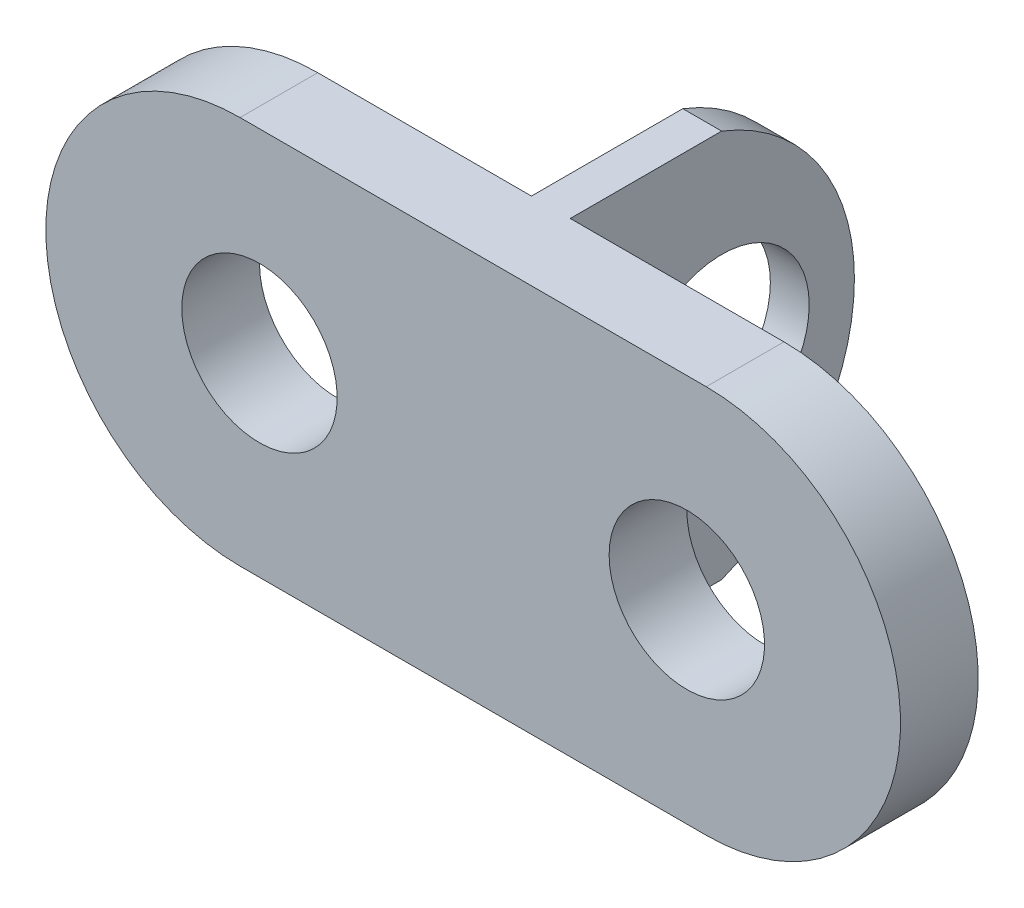
ISO-10303-21;
HEADER;
FILE_DESCRIPTION(('STEP AP214'),'2;1');
FILE_NAME('part.step','',(''),(''),'','','');
FILE_SCHEMA(('AUTOMOTIVE_DESIGN { 1 0 10303 214 1 1 1 1 }'));
ENDSEC;
DATA;
#1=APPLICATION_CONTEXT('core data for automotive mechanical design processes');
#2=APPLICATION_PROTOCOL_DEFINITION('international standard','automotive_design',2000,#1);
#3=PRODUCT_CONTEXT('',#1,'mechanical');
#4=PRODUCT('Part','Part','',(#3));
#5=PRODUCT_RELATED_PRODUCT_CATEGORY('part','',(#4));
#6=PRODUCT_DEFINITION_FORMATION('','',#4);
#7=PRODUCT_DEFINITION_CONTEXT('part definition',#1,'design');
#8=PRODUCT_DEFINITION('design','',#6,#7);
#9=PRODUCT_DEFINITION_SHAPE('','',#8);
#10=(LENGTH_UNIT() NAMED_UNIT(*) SI_UNIT(.MILLI.,.METRE.));
#11=(NAMED_UNIT(*) PLANE_ANGLE_UNIT() SI_UNIT($,.RADIAN.));
#12=(NAMED_UNIT(*) SI_UNIT($,.STERADIAN.) SOLID_ANGLE_UNIT());
#13=UNCERTAINTY_MEASURE_WITH_UNIT(LENGTH_MEASURE(1.E-05),#10,'distance_accuracy_value','');
#14=(GEOMETRIC_REPRESENTATION_CONTEXT(3) GLOBAL_UNCERTAINTY_ASSIGNED_CONTEXT((#13)) GLOBAL_UNIT_ASSIGNED_CONTEXT((#10,
#11,#12)) REPRESENTATION_CONTEXT('',''));
#15=CARTESIAN_POINT('',(0.,0.,0.));
#16=DIRECTION('',(0.,0.,1.));
#17=DIRECTION('',(1.,0.,0.));
#18=AXIS2_PLACEMENT_3D('',#15,#16,#17);
#19=CARTESIAN_POINT('',(-2.79518072289156,-4.93172690763052,0.));
#20=DIRECTION('',(0.,0.,1.));
#21=DIRECTION('',(1.,0.,0.));
#22=AXIS2_PLACEMENT_3D('',#19,#20,#21);
#23=PLANE('',#22);
#24=CARTESIAN_POINT('',(-1.79518072289156,-4.93172690763052,0.));
#25=DIRECTION('',(0.,0.,-1.));
#26=DIRECTION('',(-1.,0.,0.));
#27=AXIS2_PLACEMENT_3D('',#24,#25,#26);
#28=CIRCLE('',#27,4.);
#29=CARTESIAN_POINT('',(-5.79518072289156,-4.93172690763052,0.));
#30=VERTEX_POINT('',#29);
#31=EDGE_CURVE('E191',#30,#30,#28,.T.);
#32=ORIENTED_EDGE('',*,*,#31,.F.);
#33=EDGE_LOOP('',(#32));
#34=FACE_BOUND('',#33,.T.);
#35=DIRECTION('',(-1.,0.,0.));
#36=VECTOR('',#35,1.);
#37=CARTESIAN_POINT('',(-2.79518072289156,5.06827309236948,0.));
#38=LINE('',#37,#36);
#39=CARTESIAN_POINT('',(8.20481927710844,5.06827309236948,0.));
#40=VERTEX_POINT('',#39);
#41=CARTESIAN_POINT('',(-2.79518072289156,5.06827309236948,0.));
#42=VERTEX_POINT('',#41);
#43=EDGE_CURVE('E162',#40,#42,#38,.T.);
#44=ORIENTED_EDGE('',*,*,#43,.F.);
#45=DIRECTION('',(0.,-1.,0.));
#46=VECTOR('',#45,1.);
#47=CARTESIAN_POINT('',(8.20481927710844,5.06827309236948,0.));
#48=LINE('',#47,#46);
#49=CARTESIAN_POINT('',(8.20481927710844,-14.9317269076305,0.));
#50=VERTEX_POINT('',#49);
#51=EDGE_CURVE('E174',#40,#50,#48,.T.);
#52=ORIENTED_EDGE('',*,*,#51,.T.);
#53=DIRECTION('',(1.,0.,0.));
#54=VECTOR('',#53,1.);
#55=CARTESIAN_POINT('',(-2.79518072289156,-14.9317269076305,0.));
#56=LINE('',#55,#54);
#57=CARTESIAN_POINT('',(-2.79518072289156,-14.9317269076305,0.));
#58=VERTEX_POINT('',#57);
#59=EDGE_CURVE('E157',#58,#50,#56,.T.);
#60=ORIENTED_EDGE('',*,*,#59,.F.);
#61=CARTESIAN_POINT('',(-2.79518072289156,-4.93172690763052,0.));
#62=DIRECTION('',(0.,0.,1.));
#63=DIRECTION('',(1.,0.,0.));
#64=AXIS2_PLACEMENT_3D('',#61,#62,#63);
#65=CIRCLE('',#64,10.);
#66=EDGE_CURVE('E133',#42,#58,#65,.T.);
#67=ORIENTED_EDGE('',*,*,#66,.F.);
#68=EDGE_LOOP('',(#44,#52,#60,#67));
#69=FACE_BOUND('',#68,.T.);
#70=ADVANCED_FACE('F52',(#34,#69),#23,.F.);
#71=CARTESIAN_POINT('',(-2.79518072289156,-4.93172690763052,4.));
#72=DIRECTION('',(0.,0.,-1.));
#73=DIRECTION('',(-1.,0.,0.));
#74=AXIS2_PLACEMENT_3D('',#71,#72,#73);
#75=CYLINDRICAL_SURFACE('',#74,10.);
#76=ORIENTED_EDGE('',*,*,#66,.T.);
#77=DIRECTION('',(0.,0.,-1.));
#78=VECTOR('',#77,1.);
#79=CARTESIAN_POINT('',(-2.79518072289156,-14.9317269076305,4.));
#80=LINE('',#79,#78);
#81=CARTESIAN_POINT('',(-2.79518072289156,-14.9317269076305,4.));
#82=VERTEX_POINT('',#81);
#83=EDGE_CURVE('E60',#82,#58,#80,.T.);
#84=ORIENTED_EDGE('',*,*,#83,.F.);
#85=CARTESIAN_POINT('',(-2.79518072289156,-4.93172690763052,4.));
#86=DIRECTION('',(0.,0.,1.));
#87=DIRECTION('',(1.,0.,0.));
#88=AXIS2_PLACEMENT_3D('',#85,#86,#87);
#89=CIRCLE('',#88,10.);
#90=CARTESIAN_POINT('',(-2.79518072289156,5.06827309236948,4.));
#91=VERTEX_POINT('',#90);
#92=EDGE_CURVE('E147',#91,#82,#89,.T.);
#93=ORIENTED_EDGE('',*,*,#92,.F.);
#94=DIRECTION('',(0.,0.,-1.));
#95=VECTOR('',#94,1.);
#96=CARTESIAN_POINT('',(-2.79518072289156,5.06827309236948,4.));
#97=LINE('',#96,#95);
#98=EDGE_CURVE('E155',#91,#42,#97,.T.);
#99=ORIENTED_EDGE('',*,*,#98,.T.);
#100=EDGE_LOOP('',(#76,#84,#93,#99));
#101=FACE_BOUND('',#100,.T.);
#102=ADVANCED_FACE('F54',(#101),#75,.T.);
#103=CARTESIAN_POINT('',(-2.79518072289156,-14.9317269076305,4.));
#104=DIRECTION('',(0.,1.,0.));
#105=DIRECTION('',(0.,0.,1.));
#106=AXIS2_PLACEMENT_3D('',#103,#104,#105);
#107=PLANE('',#106);
#108=DIRECTION('',(0.,0.,1.));
#109=VECTOR('',#108,1.);
#110=CARTESIAN_POINT('',(8.20481927710844,-14.9317269076305,-15.));
#111=LINE('',#110,#109);
#112=CARTESIAN_POINT('',(8.20481927710844,-14.9317269076305,-7.79247856892908));
#113=VERTEX_POINT('',#112);
#114=EDGE_CURVE('E138',#113,#50,#111,.T.);
#115=ORIENTED_EDGE('',*,*,#114,.F.);
#116=DIRECTION('',(1.,0.,0.));
#117=VECTOR('',#116,1.);
#118=CARTESIAN_POINT('',(-12.7951807228916,-14.9317269076305,-7.79247856892908));
#119=LINE('',#118,#117);
#120=CARTESIAN_POINT('',(10.2048192771084,-14.9317269076305,-7.79247856892908));
#121=VERTEX_POINT('',#120);
#122=EDGE_CURVE('E66',#113,#121,#119,.T.);
#123=ORIENTED_EDGE('',*,*,#122,.T.);
#124=DIRECTION('',(0.,0.,1.));
#125=VECTOR('',#124,1.);
#126=CARTESIAN_POINT('',(10.2048192771084,-14.9317269076305,-15.));
#127=LINE('',#126,#125);
#128=CARTESIAN_POINT('',(10.2048192771084,-14.9317269076305,0.));
#129=VERTEX_POINT('',#128);
#130=EDGE_CURVE('E125',#121,#129,#127,.T.);
#131=ORIENTED_EDGE('',*,*,#130,.T.);
#132=CARTESIAN_POINT('',(21.2048192771084,-14.9317269076305,0.));
#133=VERTEX_POINT('',#132);
#134=EDGE_CURVE('E136',#129,#133,#56,.T.);
#135=ORIENTED_EDGE('',*,*,#134,.T.);
#136=DIRECTION('',(0.,0.,-1.));
#137=VECTOR('',#136,1.);
#138=CARTESIAN_POINT('',(21.2048192771084,-14.9317269076305,4.));
#139=LINE('',#138,#137);
#140=CARTESIAN_POINT('',(21.2048192771084,-14.9317269076305,4.));
#141=VERTEX_POINT('',#140);
#142=EDGE_CURVE('E168',#141,#133,#139,.T.);
#143=ORIENTED_EDGE('',*,*,#142,.F.);
#144=DIRECTION('',(1.,0.,0.));
#145=VECTOR('',#144,1.);
#146=CARTESIAN_POINT('',(-2.79518072289156,-14.9317269076305,4.));
#147=LINE('',#146,#145);
#148=EDGE_CURVE('E150',#82,#141,#147,.T.);
#149=ORIENTED_EDGE('',*,*,#148,.F.);
#150=ORIENTED_EDGE('',*,*,#83,.T.);
#151=ORIENTED_EDGE('',*,*,#59,.T.);
#152=EDGE_LOOP('',(#115,#123,#131,#135,#143,#149,#150,#151));
#153=FACE_BOUND('',#152,.T.);
#154=ADVANCED_FACE('F229',(#153),#107,.F.);
#155=CARTESIAN_POINT('',(21.2048192771084,-4.93172690763052,4.));
#156=DIRECTION('',(0.,0.,-1.));
#157=DIRECTION('',(-1.,0.,0.));
#158=AXIS2_PLACEMENT_3D('',#155,#156,#157);
#159=CYLINDRICAL_SURFACE('',#158,10.);
#160=CARTESIAN_POINT('',(21.2048192771084,-4.93172690763052,0.));
#161=DIRECTION('',(0.,0.,1.));
#162=DIRECTION('',(-1.,0.,0.));
#163=AXIS2_PLACEMENT_3D('',#160,#161,#162);
#164=CIRCLE('',#163,10.);
#165=CARTESIAN_POINT('',(21.2048192771084,5.06827309236948,0.));
#166=VERTEX_POINT('',#165);
#167=EDGE_CURVE('E160',#133,#166,#164,.T.);
#168=ORIENTED_EDGE('',*,*,#167,.T.);
#169=DIRECTION('',(0.,0.,-1.));
#170=VECTOR('',#169,1.);
#171=CARTESIAN_POINT('',(21.2048192771084,5.06827309236948,4.));
#172=LINE('',#171,#170);
#173=CARTESIAN_POINT('',(21.2048192771084,5.06827309236948,4.));
#174=VERTEX_POINT('',#173);
#175=EDGE_CURVE('E166',#174,#166,#172,.T.);
#176=ORIENTED_EDGE('',*,*,#175,.F.);
#177=CARTESIAN_POINT('',(21.2048192771084,-4.93172690763052,4.));
#178=DIRECTION('',(0.,0.,1.));
#179=DIRECTION('',(-1.,0.,0.));
#180=AXIS2_PLACEMENT_3D('',#177,#178,#179);
#181=CIRCLE('',#180,10.);
#182=EDGE_CURVE('E152',#141,#174,#181,.T.);
#183=ORIENTED_EDGE('',*,*,#182,.F.);
#184=ORIENTED_EDGE('',*,*,#142,.T.);
#185=EDGE_LOOP('',(#168,#176,#183,#184));
#186=FACE_BOUND('',#185,.T.);
#187=ADVANCED_FACE('F230',(#186),#159,.T.);
#188=CARTESIAN_POINT('',(-2.79518072289156,5.06827309236948,4.));
#189=DIRECTION('',(0.,-1.,0.));
#190=DIRECTION('',(1.,0.,0.));
#191=AXIS2_PLACEMENT_3D('',#188,#189,#190);
#192=PLANE('',#191);
#193=DIRECTION('',(0.,0.,1.));
#194=VECTOR('',#193,1.);
#195=CARTESIAN_POINT('',(10.2048192771084,5.06827309236948,-15.));
#196=LINE('',#195,#194);
#197=CARTESIAN_POINT('',(10.2048192771084,5.06827309236948,-7.79247856892908));
#198=VERTEX_POINT('',#197);
#199=CARTESIAN_POINT('',(10.2048192771084,5.06827309236948,0.));
#200=VERTEX_POINT('',#199);
#201=EDGE_CURVE('E74',#198,#200,#196,.T.);
#202=ORIENTED_EDGE('',*,*,#201,.F.);
#203=DIRECTION('',(1.,0.,0.));
#204=VECTOR('',#203,1.);
#205=CARTESIAN_POINT('',(-12.7951807228916,5.06827309236948,-7.79247856892908));
#206=LINE('',#205,#204);
#207=CARTESIAN_POINT('',(8.20481927710844,5.06827309236948,-7.79247856892908));
#208=VERTEX_POINT('',#207);
#209=EDGE_CURVE('E116',#208,#198,#206,.T.);
#210=ORIENTED_EDGE('',*,*,#209,.F.);
#211=DIRECTION('',(0.,0.,1.));
#212=VECTOR('',#211,1.);
#213=CARTESIAN_POINT('',(8.20481927710844,5.06827309236948,-15.));
#214=LINE('',#213,#212);
#215=EDGE_CURVE('E145',#208,#40,#214,.T.);
#216=ORIENTED_EDGE('',*,*,#215,.T.);
#217=ORIENTED_EDGE('',*,*,#43,.T.);
#218=ORIENTED_EDGE('',*,*,#98,.F.);
#219=DIRECTION('',(-1.,0.,0.));
#220=VECTOR('',#219,1.);
#221=CARTESIAN_POINT('',(-2.79518072289156,5.06827309236948,4.));
#222=LINE('',#221,#220);
#223=EDGE_CURVE('E154',#174,#91,#222,.T.);
#224=ORIENTED_EDGE('',*,*,#223,.F.);
#225=ORIENTED_EDGE('',*,*,#175,.T.);
#226=EDGE_CURVE('E132',#166,#200,#38,.T.);
#227=ORIENTED_EDGE('',*,*,#226,.T.);
#228=EDGE_LOOP('',(#202,#210,#216,#217,#218,#224,#225,#227));
#229=FACE_BOUND('',#228,.T.);
#230=ADVANCED_FACE('F129',(#229),#192,.F.);
#231=CARTESIAN_POINT('',(-2.79518072289156,-4.93172690763052,4.));
#232=DIRECTION('',(0.,0.,1.));
#233=DIRECTION('',(1.,0.,0.));
#234=AXIS2_PLACEMENT_3D('',#231,#232,#233);
#235=PLANE('',#234);
#236=CARTESIAN_POINT('',(-1.79518072289156,-4.93172690763052,4.));
#237=DIRECTION('',(0.,0.,-1.));
#238=DIRECTION('',(-1.,0.,0.));
#239=AXIS2_PLACEMENT_3D('',#236,#237,#238);
#240=CIRCLE('',#239,4.);
#241=CARTESIAN_POINT('',(-5.79518072289156,-4.93172690763052,4.));
#242=VERTEX_POINT('',#241);
#243=EDGE_CURVE('E188',#242,#242,#240,.T.);
#244=ORIENTED_EDGE('',*,*,#243,.T.);
#245=EDGE_LOOP('',(#244));
#246=FACE_BOUND('',#245,.T.);
#247=CARTESIAN_POINT('',(20.2048192771084,-4.93172690763052,4.));
#248=DIRECTION('',(0.,0.,-1.));
#249=DIRECTION('',(-1.,0.,0.));
#250=AXIS2_PLACEMENT_3D('',#247,#248,#249);
#251=CIRCLE('',#250,4.);
#252=CARTESIAN_POINT('',(16.2048192771084,-4.93172690763052,4.));
#253=VERTEX_POINT('',#252);
#254=EDGE_CURVE('E126',#253,#253,#251,.T.);
#255=ORIENTED_EDGE('',*,*,#254,.T.);
#256=EDGE_LOOP('',(#255));
#257=FACE_BOUND('',#256,.T.);
#258=ORIENTED_EDGE('',*,*,#92,.T.);
#259=ORIENTED_EDGE('',*,*,#148,.T.);
#260=ORIENTED_EDGE('',*,*,#182,.T.);
#261=ORIENTED_EDGE('',*,*,#223,.T.);
#262=EDGE_LOOP('',(#258,#259,#260,#261));
#263=FACE_BOUND('',#262,.T.);
#264=ADVANCED_FACE('F197',(#246,#257,#263),#235,.T.);
#265=CARTESIAN_POINT('',(20.2048192771084,-4.93172690763052,0.));
#266=DIRECTION('',(0.,0.,-1.));
#267=DIRECTION('',(-1.,0.,0.));
#268=AXIS2_PLACEMENT_3D('',#265,#266,#267);
#269=CIRCLE('',#268,4.);
#270=CARTESIAN_POINT('',(16.2048192771084,-4.93172690763052,0.));
#271=VERTEX_POINT('',#270);
#272=EDGE_CURVE('E185',#271,#271,#269,.T.);
#273=ORIENTED_EDGE('',*,*,#272,.F.);
#274=EDGE_LOOP('',(#273));
#275=FACE_BOUND('',#274,.T.);
#276=ORIENTED_EDGE('',*,*,#134,.F.);
#277=DIRECTION('',(0.,1.,0.));
#278=VECTOR('',#277,1.);
#279=CARTESIAN_POINT('',(10.2048192771084,-14.9317269076305,0.));
#280=LINE('',#279,#278);
#281=EDGE_CURVE('E141',#129,#200,#280,.T.);
#282=ORIENTED_EDGE('',*,*,#281,.T.);
#283=ORIENTED_EDGE('',*,*,#226,.F.);
#284=ORIENTED_EDGE('',*,*,#167,.F.);
#285=EDGE_LOOP('',(#276,#282,#283,#284));
#286=FACE_BOUND('',#285,.T.);
#287=ADVANCED_FACE('F210',(#275,#286),#23,.F.);
#288=CARTESIAN_POINT('',(10.2048192771084,-14.9317269076305,-15.));
#289=DIRECTION('',(1.,0.,0.));
#290=DIRECTION('',(0.,0.,-1.));
#291=AXIS2_PLACEMENT_3D('',#288,#289,#290);
#292=PLANE('',#291);
#293=CARTESIAN_POINT('',(10.2048192771084,-4.93172690763052,-3.89623928446454));
#294=DIRECTION('',(1.,0.,0.));
#295=DIRECTION('',(0.,0.,-1.));
#296=AXIS2_PLACEMENT_3D('',#293,#294,#295);
#297=CIRCLE('',#296,10.7322262630735);
#298=EDGE_CURVE('E118',#198,#121,#297,.F.);
#299=ORIENTED_EDGE('',*,*,#298,.F.);
#300=ORIENTED_EDGE('',*,*,#201,.T.);
#301=ORIENTED_EDGE('',*,*,#281,.F.);
#302=ORIENTED_EDGE('',*,*,#130,.F.);
#303=EDGE_LOOP('',(#299,#300,#301,#302));
#304=FACE_BOUND('',#303,.T.);
#305=CARTESIAN_POINT('',(10.2048192771084,-4.93172690763052,-7.8));
#306=DIRECTION('',(1.,0.,0.));
#307=DIRECTION('',(0.,0.,-1.));
#308=AXIS2_PLACEMENT_3D('',#305,#306,#307);
#309=CIRCLE('',#308,4.5);
#310=CARTESIAN_POINT('',(10.2048192771084,-4.93172690763052,-12.3));
#311=VERTEX_POINT('',#310);
#312=EDGE_CURVE('E175',#311,#311,#309,.T.);
#313=ORIENTED_EDGE('',*,*,#312,.F.);
#314=EDGE_LOOP('',(#313));
#315=FACE_BOUND('',#314,.T.);
#316=ADVANCED_FACE('F123',(#304,#315),#292,.T.);
#317=CARTESIAN_POINT('',(8.20481927710844,5.06827309236948,-15.));
#318=DIRECTION('',(-1.,0.,0.));
#319=DIRECTION('',(0.,-1.,0.));
#320=AXIS2_PLACEMENT_3D('',#317,#318,#319);
#321=PLANE('',#320);
#322=CARTESIAN_POINT('',(8.20481927710844,-4.93172690763052,-3.89623928446454));
#323=DIRECTION('',(-1.,0.,0.));
#324=DIRECTION('',(0.,-1.,0.));
#325=AXIS2_PLACEMENT_3D('',#322,#323,#324);
#326=CIRCLE('',#325,10.7322262630735);
#327=EDGE_CURVE('E12',#113,#208,#326,.F.);
#328=ORIENTED_EDGE('',*,*,#327,.F.);
#329=ORIENTED_EDGE('',*,*,#114,.T.);
#330=ORIENTED_EDGE('',*,*,#51,.F.);
#331=ORIENTED_EDGE('',*,*,#215,.F.);
#332=EDGE_LOOP('',(#328,#329,#330,#331));
#333=FACE_BOUND('',#332,.T.);
#334=CARTESIAN_POINT('',(8.20481927710844,-4.93172690763052,-7.8));
#335=DIRECTION('',(-1.,0.,0.));
#336=DIRECTION('',(0.,-1.,0.));
#337=AXIS2_PLACEMENT_3D('',#334,#335,#336);
#338=CIRCLE('',#337,4.5);
#339=CARTESIAN_POINT('',(8.20481927710844,-9.43172690763052,-7.8));
#340=VERTEX_POINT('',#339);
#341=EDGE_CURVE('E172',#340,#340,#338,.T.);
#342=ORIENTED_EDGE('',*,*,#341,.F.);
#343=EDGE_LOOP('',(#342));
#344=FACE_BOUND('',#343,.T.);
#345=ADVANCED_FACE('F243',(#333,#344),#321,.T.);
#346=CARTESIAN_POINT('',(-12.7951807228916,-4.93172690763052,-7.8));
#347=DIRECTION('',(1.,0.,0.));
#348=DIRECTION('',(0.,0.,-1.));
#349=AXIS2_PLACEMENT_3D('',#346,#347,#348);
#350=CYLINDRICAL_SURFACE('',#349,4.5);
#351=ORIENTED_EDGE('',*,*,#341,.T.);
#352=EDGE_LOOP('',(#351));
#353=FACE_BOUND('',#352,.T.);
#354=ORIENTED_EDGE('',*,*,#312,.T.);
#355=EDGE_LOOP('',(#354));
#356=FACE_BOUND('',#355,.T.);
#357=ADVANCED_FACE('F246',(#353,#356),#350,.F.);
#358=CARTESIAN_POINT('',(-12.7951807228916,-4.93172690763052,-3.89623928446454));
#359=DIRECTION('',(1.,0.,0.));
#360=DIRECTION('',(0.,0.,-1.));
#361=AXIS2_PLACEMENT_3D('',#358,#359,#360);
#362=CYLINDRICAL_SURFACE('',#361,10.7322262630735);
#363=ORIENTED_EDGE('',*,*,#327,.T.);
#364=ORIENTED_EDGE('',*,*,#209,.T.);
#365=ORIENTED_EDGE('',*,*,#298,.T.);
#366=ORIENTED_EDGE('',*,*,#122,.F.);
#367=EDGE_LOOP('',(#363,#364,#365,#366));
#368=FACE_BOUND('',#367,.T.);
#369=ADVANCED_FACE('F117',(#368),#362,.T.);
#370=CARTESIAN_POINT('',(20.2048192771084,-4.93172690763052,4.));
#371=DIRECTION('',(0.,0.,-1.));
#372=DIRECTION('',(-1.,0.,0.));
#373=AXIS2_PLACEMENT_3D('',#370,#371,#372);
#374=CYLINDRICAL_SURFACE('',#373,4.);
#375=ORIENTED_EDGE('',*,*,#254,.F.);
#376=EDGE_LOOP('',(#375));
#377=FACE_BOUND('',#376,.T.);
#378=ORIENTED_EDGE('',*,*,#272,.T.);
#379=EDGE_LOOP('',(#378));
#380=FACE_BOUND('',#379,.T.);
#381=ADVANCED_FACE('F203',(#377,#380),#374,.F.);
#382=CARTESIAN_POINT('',(-1.79518072289156,-4.93172690763052,4.));
#383=DIRECTION('',(0.,0.,-1.));
#384=DIRECTION('',(-1.,0.,0.));
#385=AXIS2_PLACEMENT_3D('',#382,#383,#384);
#386=CYLINDRICAL_SURFACE('',#385,4.);
#387=ORIENTED_EDGE('',*,*,#243,.F.);
#388=EDGE_LOOP('',(#387));
#389=FACE_BOUND('',#388,.T.);
#390=ORIENTED_EDGE('',*,*,#31,.T.);
#391=EDGE_LOOP('',(#390));
#392=FACE_BOUND('',#391,.T.);
#393=ADVANCED_FACE('F200',(#389,#392),#386,.F.);
#394=CLOSED_SHELL('',(#70,#102,#154,#187,#230,#264,#287,#316,#345,#357,#369,#381,#393));
#395=MANIFOLD_SOLID_BREP('B2',#394);
#396=ADVANCED_BREP_SHAPE_REPRESENTATION('',(#18,#395),#14);
#397=SHAPE_DEFINITION_REPRESENTATION(#9,#396);
ENDSEC;
END-ISO-10303-21;
